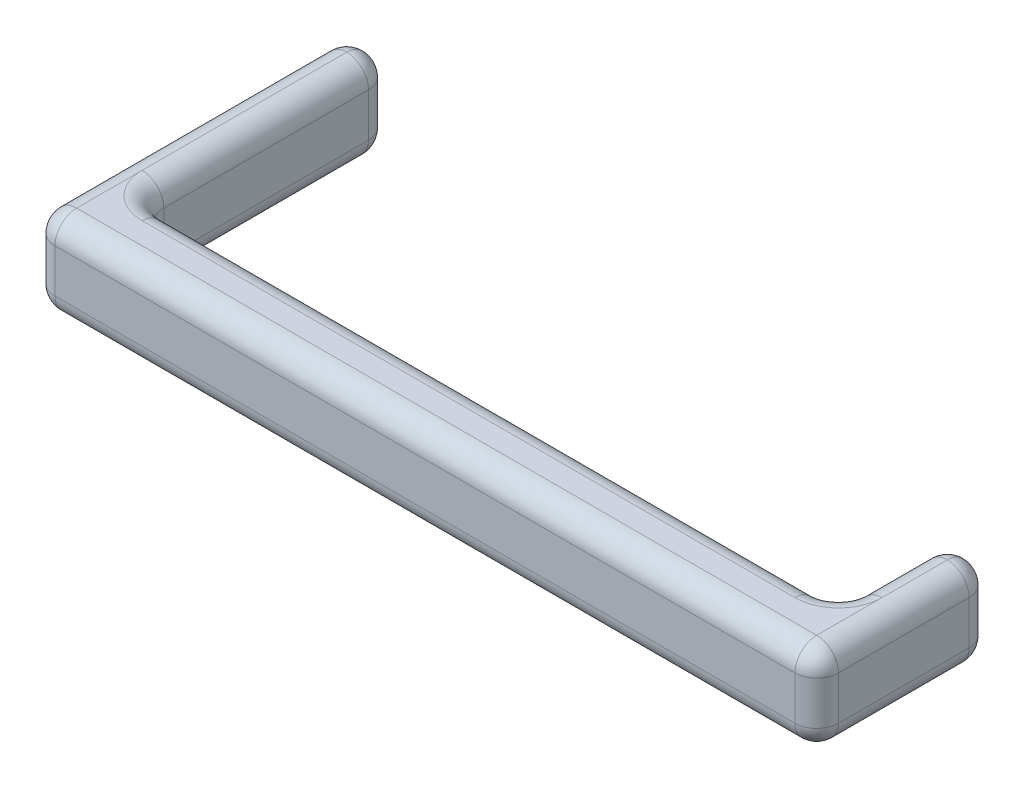
ISO-10303-21;
HEADER;
FILE_DESCRIPTION(('STEP AP214'),'2;1');
FILE_NAME('part.step','',(''),(''),'','','');
FILE_SCHEMA(('AUTOMOTIVE_DESIGN { 1 0 10303 214 1 1 1 1 }'));
ENDSEC;
DATA;
#1=APPLICATION_CONTEXT('core data for automotive mechanical design processes');
#2=APPLICATION_PROTOCOL_DEFINITION('international standard','automotive_design',2000,#1);
#3=PRODUCT_CONTEXT('',#1,'mechanical');
#4=PRODUCT('Part','Part','',(#3));
#5=PRODUCT_RELATED_PRODUCT_CATEGORY('part','',(#4));
#6=PRODUCT_DEFINITION_FORMATION('','',#4);
#7=PRODUCT_DEFINITION_CONTEXT('part definition',#1,'design');
#8=PRODUCT_DEFINITION('design','',#6,#7);
#9=PRODUCT_DEFINITION_SHAPE('','',#8);
#10=(LENGTH_UNIT() NAMED_UNIT(*) SI_UNIT(.MILLI.,.METRE.));
#11=(NAMED_UNIT(*) PLANE_ANGLE_UNIT() SI_UNIT($,.RADIAN.));
#12=(NAMED_UNIT(*) SI_UNIT($,.STERADIAN.) SOLID_ANGLE_UNIT());
#13=UNCERTAINTY_MEASURE_WITH_UNIT(LENGTH_MEASURE(1.E-05),#10,'distance_accuracy_value','');
#14=(GEOMETRIC_REPRESENTATION_CONTEXT(3) GLOBAL_UNCERTAINTY_ASSIGNED_CONTEXT((#13)) GLOBAL_UNIT_ASSIGNED_CONTEXT((#10,
#11,#12)) REPRESENTATION_CONTEXT('',''));
#15=CARTESIAN_POINT('',(0.,0.,0.));
#16=DIRECTION('',(0.,0.,1.));
#17=DIRECTION('',(1.,0.,0.));
#18=AXIS2_PLACEMENT_3D('',#15,#16,#17);
#19=CARTESIAN_POINT('',(0.,101.6,76.2));
#20=DIRECTION('',(0.,-1.,0.));
#21=DIRECTION('',(1.,0.,0.));
#22=AXIS2_PLACEMENT_3D('',#19,#20,#21);
#23=PLANE('',#22);
#24=CARTESIAN_POINT('',(-787.4,101.6,-25.4));
#25=DIRECTION('',(0.,-1.,0.));
#26=DIRECTION('',(1.,0.,0.));
#27=AXIS2_PLACEMENT_3D('',#24,#25,#26);
#28=CIRCLE('',#27,50.8);
#29=CARTESIAN_POINT('',(-838.2,101.6,-25.4));
#30=VERTEX_POINT('',#29);
#31=CARTESIAN_POINT('',(-787.4,101.6,25.4));
#32=VERTEX_POINT('',#31);
#33=EDGE_CURVE('E384',#30,#32,#28,.F.);
#34=ORIENTED_EDGE('',*,*,#33,.F.);
#35=DIRECTION('',(0.,0.,1.));
#36=VECTOR('',#35,1.);
#37=CARTESIAN_POINT('',(-838.2,101.6,76.2));
#38=LINE('',#37,#36);
#39=CARTESIAN_POINT('',(-838.2,101.6,50.8));
#40=VERTEX_POINT('',#39);
#41=EDGE_CURVE('E382',#30,#40,#38,.T.);
#42=ORIENTED_EDGE('',*,*,#41,.T.);
#43=DIRECTION('',(-1.,0.,0.));
#44=VECTOR('',#43,1.);
#45=CARTESIAN_POINT('',(50.8,101.6,50.8));
#46=LINE('',#45,#44);
#47=CARTESIAN_POINT('',(25.4,101.6,50.8));
#48=VERTEX_POINT('',#47);
#49=EDGE_CURVE('E375',#40,#48,#46,.F.);
#50=ORIENTED_EDGE('',*,*,#49,.T.);
#51=DIRECTION('',(0.,0.,1.));
#52=VECTOR('',#51,1.);
#53=CARTESIAN_POINT('',(25.4,101.6,76.2));
#54=LINE('',#53,#52);
#55=CARTESIAN_POINT('',(25.4,101.6,-25.4));
#56=VERTEX_POINT('',#55);
#57=EDGE_CURVE('E373',#48,#56,#54,.F.);
#58=ORIENTED_EDGE('',*,*,#57,.T.);
#59=CARTESIAN_POINT('',(-25.4,101.6,-25.4));
#60=DIRECTION('',(0.,-1.,0.));
#61=DIRECTION('',(1.,0.,0.));
#62=AXIS2_PLACEMENT_3D('',#59,#60,#61);
#63=CIRCLE('',#62,50.8);
#64=CARTESIAN_POINT('',(-25.4,101.6,25.4));
#65=VERTEX_POINT('',#64);
#66=EDGE_CURVE('E377',#65,#56,#63,.F.);
#67=ORIENTED_EDGE('',*,*,#66,.F.);
#68=DIRECTION('',(-1.,0.,0.));
#69=VECTOR('',#68,1.);
#70=CARTESIAN_POINT('',(0.,101.6,25.4));
#71=LINE('',#70,#69);
#72=EDGE_CURVE('E380',#65,#32,#71,.T.);
#73=ORIENTED_EDGE('',*,*,#72,.T.);
#74=EDGE_LOOP('',(#34,#42,#50,#58,#67,#73));
#75=FACE_BOUND('',#74,.T.);
#76=ADVANCED_FACE('F38',(#75),#23,.F.);
#77=CARTESIAN_POINT('',(0.,0.,76.2));
#78=DIRECTION('',(0.,1.,0.));
#79=DIRECTION('',(0.,0.,1.));
#80=AXIS2_PLACEMENT_3D('',#77,#78,#79);
#81=PLANE('',#80);
#82=DIRECTION('',(1.,0.,0.));
#83=VECTOR('',#82,1.);
#84=CARTESIAN_POINT('',(-863.6,0.,50.8));
#85=LINE('',#84,#83);
#86=CARTESIAN_POINT('',(25.4,0.,50.8));
#87=VERTEX_POINT('',#86);
#88=CARTESIAN_POINT('',(-838.2,0.,50.8));
#89=VERTEX_POINT('',#88);
#90=EDGE_CURVE('E350',#87,#89,#85,.F.);
#91=ORIENTED_EDGE('',*,*,#90,.T.);
#92=DIRECTION('',(0.,0.,1.));
#93=VECTOR('',#92,1.);
#94=CARTESIAN_POINT('',(-838.2,0.,-289.687));
#95=LINE('',#94,#93);
#96=CARTESIAN_POINT('',(-838.2,0.,-25.4));
#97=VERTEX_POINT('',#96);
#98=EDGE_CURVE('E352',#89,#97,#95,.F.);
#99=ORIENTED_EDGE('',*,*,#98,.T.);
#100=CARTESIAN_POINT('',(-787.4,0.,-25.4));
#101=DIRECTION('',(0.,1.,0.));
#102=DIRECTION('',(0.,0.,1.));
#103=AXIS2_PLACEMENT_3D('',#100,#101,#102);
#104=CIRCLE('',#103,50.8);
#105=CARTESIAN_POINT('',(-787.4,0.,25.4));
#106=VERTEX_POINT('',#105);
#107=EDGE_CURVE('E347',#106,#97,#104,.F.);
#108=ORIENTED_EDGE('',*,*,#107,.F.);
#109=DIRECTION('',(1.,0.,0.));
#110=VECTOR('',#109,1.);
#111=CARTESIAN_POINT('',(0.,0.,25.4));
#112=LINE('',#111,#110);
#113=CARTESIAN_POINT('',(-25.4,0.,25.4));
#114=VERTEX_POINT('',#113);
#115=EDGE_CURVE('E345',#106,#114,#112,.T.);
#116=ORIENTED_EDGE('',*,*,#115,.T.);
#117=CARTESIAN_POINT('',(-25.4,0.,-25.4));
#118=DIRECTION('',(0.,1.,0.));
#119=DIRECTION('',(0.,0.,1.));
#120=AXIS2_PLACEMENT_3D('',#117,#118,#119);
#121=CIRCLE('',#120,50.8);
#122=CARTESIAN_POINT('',(25.4,0.,-25.4));
#123=VERTEX_POINT('',#122);
#124=EDGE_CURVE('E342',#123,#114,#121,.F.);
#125=ORIENTED_EDGE('',*,*,#124,.F.);
#126=DIRECTION('',(0.,0.,1.));
#127=VECTOR('',#126,1.);
#128=CARTESIAN_POINT('',(25.4,0.,76.2));
#129=LINE('',#128,#127);
#130=EDGE_CURVE('E340',#123,#87,#129,.T.);
#131=ORIENTED_EDGE('',*,*,#130,.T.);
#132=EDGE_LOOP('',(#91,#99,#108,#116,#125,#131));
#133=FACE_BOUND('',#132,.T.);
#134=ADVANCED_FACE('F458',(#133),#81,.F.);
#135=CARTESIAN_POINT('',(0.,0.,76.2));
#136=DIRECTION('',(0.,0.,1.));
#137=DIRECTION('',(1.,0.,0.));
#138=AXIS2_PLACEMENT_3D('',#135,#136,#137);
#139=PLANE('',#138);
#140=DIRECTION('',(-1.,0.,0.));
#141=VECTOR('',#140,1.);
#142=CARTESIAN_POINT('',(-863.6,76.1999999999999,76.2));
#143=LINE('',#142,#141);
#144=CARTESIAN_POINT('',(25.4,76.2,76.2));
#145=VERTEX_POINT('',#144);
#146=CARTESIAN_POINT('',(-838.2,76.1999999999999,76.2));
#147=VERTEX_POINT('',#146);
#148=EDGE_CURVE('E324',#145,#147,#143,.T.);
#149=ORIENTED_EDGE('',*,*,#148,.T.);
#150=DIRECTION('',(0.,-1.,0.));
#151=VECTOR('',#150,1.);
#152=CARTESIAN_POINT('',(-838.2,0.,76.2));
#153=LINE('',#152,#151);
#154=CARTESIAN_POINT('',(-838.2,25.4,76.2));
#155=VERTEX_POINT('',#154);
#156=EDGE_CURVE('E329',#147,#155,#153,.T.);
#157=ORIENTED_EDGE('',*,*,#156,.T.);
#158=DIRECTION('',(1.,0.,0.));
#159=VECTOR('',#158,1.);
#160=CARTESIAN_POINT('',(50.8,25.4,76.2));
#161=LINE('',#160,#159);
#162=CARTESIAN_POINT('',(25.4,25.4,76.2));
#163=VERTEX_POINT('',#162);
#164=EDGE_CURVE('E98',#155,#163,#161,.T.);
#165=ORIENTED_EDGE('',*,*,#164,.T.);
#166=DIRECTION('',(0.,-1.,0.));
#167=VECTOR('',#166,1.);
#168=CARTESIAN_POINT('',(25.4,101.6,76.2));
#169=LINE('',#168,#167);
#170=EDGE_CURVE('E221',#163,#145,#169,.F.);
#171=ORIENTED_EDGE('',*,*,#170,.T.);
#172=EDGE_LOOP('',(#149,#157,#165,#171));
#173=FACE_BOUND('',#172,.T.);
#174=ADVANCED_FACE('F545',(#173),#139,.T.);
#175=CARTESIAN_POINT('',(0.,0.,0.));
#176=DIRECTION('',(0.,0.,1.));
#177=DIRECTION('',(1.,0.,0.));
#178=AXIS2_PLACEMENT_3D('',#175,#176,#177);
#179=PLANE('',#178);
#180=DIRECTION('',(0.,-1.,0.));
#181=VECTOR('',#180,1.);
#182=CARTESIAN_POINT('',(-787.4,101.6,0.));
#183=LINE('',#182,#181);
#184=CARTESIAN_POINT('',(-787.4,25.4,0.));
#185=VERTEX_POINT('',#184);
#186=CARTESIAN_POINT('',(-787.4,76.1999999999999,0.));
#187=VERTEX_POINT('',#186);
#188=EDGE_CURVE('E391',#185,#187,#183,.F.);
#189=ORIENTED_EDGE('',*,*,#188,.T.);
#190=DIRECTION('',(-1.,0.,0.));
#191=VECTOR('',#190,1.);
#192=CARTESIAN_POINT('',(0.,76.2,0.));
#193=LINE('',#192,#191);
#194=CARTESIAN_POINT('',(-25.4,76.2,0.));
#195=VERTEX_POINT('',#194);
#196=EDGE_CURVE('E204',#187,#195,#193,.F.);
#197=ORIENTED_EDGE('',*,*,#196,.T.);
#198=DIRECTION('',(0.,1.,0.));
#199=VECTOR('',#198,1.);
#200=CARTESIAN_POINT('',(-25.4,0.,0.));
#201=LINE('',#200,#199);
#202=CARTESIAN_POINT('',(-25.4,25.4,0.));
#203=VERTEX_POINT('',#202);
#204=EDGE_CURVE('E387',#195,#203,#201,.F.);
#205=ORIENTED_EDGE('',*,*,#204,.T.);
#206=DIRECTION('',(1.,0.,0.));
#207=VECTOR('',#206,1.);
#208=CARTESIAN_POINT('',(0.,25.4,0.));
#209=LINE('',#208,#207);
#210=EDGE_CURVE('E389',#203,#185,#209,.F.);
#211=ORIENTED_EDGE('',*,*,#210,.T.);
#212=EDGE_LOOP('',(#189,#197,#205,#211));
#213=FACE_BOUND('',#212,.T.);
#214=ADVANCED_FACE('F500',(#213),#179,.F.);
#215=CARTESIAN_POINT('',(-812.8,101.6,-127.));
#216=DIRECTION('',(-1.,0.,0.));
#217=DIRECTION('',(0.,0.,1.));
#218=AXIS2_PLACEMENT_3D('',#215,#216,#217);
#219=PLANE('',#218);
#220=DIRECTION('',(0.,0.,1.));
#221=VECTOR('',#220,1.);
#222=CARTESIAN_POINT('',(-812.8,25.4,-127.));
#223=LINE('',#222,#221);
#224=CARTESIAN_POINT('',(-812.8,25.4,-25.4));
#225=VERTEX_POINT('',#224);
#226=CARTESIAN_POINT('',(-812.8,25.4,-264.287));
#227=VERTEX_POINT('',#226);
#228=EDGE_CURVE('E368',#225,#227,#223,.F.);
#229=ORIENTED_EDGE('',*,*,#228,.T.);
#230=DIRECTION('',(0.,1.,0.));
#231=VECTOR('',#230,1.);
#232=CARTESIAN_POINT('',(-812.8,101.6,-264.287));
#233=LINE('',#232,#231);
#234=CARTESIAN_POINT('',(-812.8,76.1999999999999,-264.287));
#235=VERTEX_POINT('',#234);
#236=EDGE_CURVE('E371',#227,#235,#233,.T.);
#237=ORIENTED_EDGE('',*,*,#236,.T.);
#238=DIRECTION('',(0.,0.,1.));
#239=VECTOR('',#238,1.);
#240=CARTESIAN_POINT('',(-812.8,76.1999999999999,-127.));
#241=LINE('',#240,#239);
#242=CARTESIAN_POINT('',(-812.8,76.1999999999999,-25.4));
#243=VERTEX_POINT('',#242);
#244=EDGE_CURVE('E366',#235,#243,#241,.T.);
#245=ORIENTED_EDGE('',*,*,#244,.T.);
#246=DIRECTION('',(0.,-1.,0.));
#247=VECTOR('',#246,1.);
#248=CARTESIAN_POINT('',(-812.8,0.,-25.4));
#249=LINE('',#248,#247);
#250=EDGE_CURVE('E364',#243,#225,#249,.T.);
#251=ORIENTED_EDGE('',*,*,#250,.T.);
#252=EDGE_LOOP('',(#229,#237,#245,#251));
#253=FACE_BOUND('',#252,.T.);
#254=ADVANCED_FACE('F443',(#253),#219,.F.);
#255=CARTESIAN_POINT('',(-863.6,101.6,-127.));
#256=DIRECTION('',(-1.,0.,0.));
#257=DIRECTION('',(0.,0.,1.));
#258=AXIS2_PLACEMENT_3D('',#255,#256,#257);
#259=PLANE('',#258);
#260=DIRECTION('',(0.,0.,1.));
#261=VECTOR('',#260,1.);
#262=CARTESIAN_POINT('',(-863.6,25.4,76.2));
#263=LINE('',#262,#261);
#264=CARTESIAN_POINT('',(-863.6,25.4,-264.287));
#265=VERTEX_POINT('',#264);
#266=CARTESIAN_POINT('',(-863.6,25.4,50.8));
#267=VERTEX_POINT('',#266);
#268=EDGE_CURVE('E335',#265,#267,#263,.T.);
#269=ORIENTED_EDGE('',*,*,#268,.T.);
#270=DIRECTION('',(0.,-1.,0.));
#271=VECTOR('',#270,1.);
#272=CARTESIAN_POINT('',(-863.6,101.6,50.8));
#273=LINE('',#272,#271);
#274=CARTESIAN_POINT('',(-863.6,76.1999999999999,50.8));
#275=VERTEX_POINT('',#274);
#276=EDGE_CURVE('E337',#267,#275,#273,.F.);
#277=ORIENTED_EDGE('',*,*,#276,.T.);
#278=DIRECTION('',(0.,0.,1.));
#279=VECTOR('',#278,1.);
#280=CARTESIAN_POINT('',(-863.6,76.1999999999999,-289.687));
#281=LINE('',#280,#279);
#282=CARTESIAN_POINT('',(-863.6,76.1999999999999,-264.287));
#283=VERTEX_POINT('',#282);
#284=EDGE_CURVE('E333',#275,#283,#281,.F.);
#285=ORIENTED_EDGE('',*,*,#284,.T.);
#286=DIRECTION('',(0.,-1.,0.));
#287=VECTOR('',#286,1.);
#288=CARTESIAN_POINT('',(-863.6,101.6,-264.287));
#289=LINE('',#288,#287);
#290=EDGE_CURVE('E331',#283,#265,#289,.T.);
#291=ORIENTED_EDGE('',*,*,#290,.T.);
#292=EDGE_LOOP('',(#269,#277,#285,#291));
#293=FACE_BOUND('',#292,.T.);
#294=ADVANCED_FACE('F475',(#293),#259,.T.);
#295=CARTESIAN_POINT('',(0.,101.6,-127.));
#296=DIRECTION('',(-1.,0.,0.));
#297=DIRECTION('',(0.,0.,1.));
#298=AXIS2_PLACEMENT_3D('',#295,#296,#297);
#299=PLANE('',#298);
#300=DIRECTION('',(0.,0.,1.));
#301=VECTOR('',#300,1.);
#302=CARTESIAN_POINT('',(0.,76.2,-127.));
#303=LINE('',#302,#301);
#304=CARTESIAN_POINT('',(0.,76.2,-25.4));
#305=VERTEX_POINT('',#304);
#306=CARTESIAN_POINT('',(0.,76.2,-101.6));
#307=VERTEX_POINT('',#306);
#308=EDGE_CURVE('E357',#305,#307,#303,.F.);
#309=ORIENTED_EDGE('',*,*,#308,.T.);
#310=DIRECTION('',(0.,-1.,0.));
#311=VECTOR('',#310,1.);
#312=CARTESIAN_POINT('',(0.,101.6,-101.6));
#313=LINE('',#312,#311);
#314=CARTESIAN_POINT('',(0.,25.4,-101.6));
#315=VERTEX_POINT('',#314);
#316=EDGE_CURVE('E362',#307,#315,#313,.T.);
#317=ORIENTED_EDGE('',*,*,#316,.T.);
#318=DIRECTION('',(0.,0.,1.));
#319=VECTOR('',#318,1.);
#320=CARTESIAN_POINT('',(0.,25.4,0.));
#321=LINE('',#320,#319);
#322=CARTESIAN_POINT('',(0.,25.4,-25.4));
#323=VERTEX_POINT('',#322);
#324=EDGE_CURVE('E359',#315,#323,#321,.T.);
#325=ORIENTED_EDGE('',*,*,#324,.T.);
#326=DIRECTION('',(0.,1.,0.));
#327=VECTOR('',#326,1.);
#328=CARTESIAN_POINT('',(0.,101.6,-25.4));
#329=LINE('',#328,#327);
#330=EDGE_CURVE('E355',#323,#305,#329,.T.);
#331=ORIENTED_EDGE('',*,*,#330,.T.);
#332=EDGE_LOOP('',(#309,#317,#325,#331));
#333=FACE_BOUND('',#332,.T.);
#334=ADVANCED_FACE('F523',(#333),#299,.T.);
#335=CARTESIAN_POINT('',(50.8,101.6,-127.));
#336=DIRECTION('',(-1.,0.,0.));
#337=DIRECTION('',(0.,-1.,0.));
#338=AXIS2_PLACEMENT_3D('',#335,#336,#337);
#339=PLANE('',#338);
#340=DIRECTION('',(0.,-1.,0.));
#341=VECTOR('',#340,1.);
#342=CARTESIAN_POINT('',(50.8,101.6,-101.6));
#343=LINE('',#342,#341);
#344=CARTESIAN_POINT('',(50.8,25.4,-101.6));
#345=VERTEX_POINT('',#344);
#346=CARTESIAN_POINT('',(50.8,76.2,-101.6));
#347=VERTEX_POINT('',#346);
#348=EDGE_CURVE('E48',#345,#347,#343,.F.);
#349=ORIENTED_EDGE('',*,*,#348,.T.);
#350=DIRECTION('',(0.,0.,1.));
#351=VECTOR('',#350,1.);
#352=CARTESIAN_POINT('',(50.8,76.2,-127.));
#353=LINE('',#352,#351);
#354=CARTESIAN_POINT('',(50.8,76.2,50.8));
#355=VERTEX_POINT('',#354);
#356=EDGE_CURVE('E11',#347,#355,#353,.T.);
#357=ORIENTED_EDGE('',*,*,#356,.T.);
#358=DIRECTION('',(0.,-1.,0.));
#359=VECTOR('',#358,1.);
#360=CARTESIAN_POINT('',(50.8,0.,50.8));
#361=LINE('',#360,#359);
#362=CARTESIAN_POINT('',(50.8,25.4,50.8));
#363=VERTEX_POINT('',#362);
#364=EDGE_CURVE('E196',#355,#363,#361,.T.);
#365=ORIENTED_EDGE('',*,*,#364,.T.);
#366=DIRECTION('',(0.,0.,1.));
#367=VECTOR('',#366,1.);
#368=CARTESIAN_POINT('',(50.8,25.4,-127.));
#369=LINE('',#368,#367);
#370=EDGE_CURVE('E199',#363,#345,#369,.F.);
#371=ORIENTED_EDGE('',*,*,#370,.T.);
#372=EDGE_LOOP('',(#349,#357,#365,#371));
#373=FACE_BOUND('',#372,.T.);
#374=ADVANCED_FACE('F198',(#373),#339,.F.);
#375=CARTESIAN_POINT('',(25.4,101.6,-101.6));
#376=DIRECTION('',(0.,-1.,0.));
#377=DIRECTION('',(0.,0.,-1.));
#378=AXIS2_PLACEMENT_3D('',#375,#376,#377);
#379=CYLINDRICAL_SURFACE('',#378,25.4);
#380=CARTESIAN_POINT('',(25.4,25.4,-101.6));
#381=DIRECTION('',(0.,-1.,0.));
#382=DIRECTION('',(0.,0.,-1.));
#383=AXIS2_PLACEMENT_3D('',#380,#381,#382);
#384=CIRCLE('',#383,25.4);
#385=CARTESIAN_POINT('',(25.4,25.4,-127.));
#386=VERTEX_POINT('',#385);
#387=EDGE_CURVE('E311',#315,#386,#384,.T.);
#388=ORIENTED_EDGE('',*,*,#387,.F.);
#389=ORIENTED_EDGE('',*,*,#316,.F.);
#390=CARTESIAN_POINT('',(25.4,76.2,-101.6));
#391=DIRECTION('',(0.,1.,0.));
#392=DIRECTION('',(0.,0.,1.));
#393=AXIS2_PLACEMENT_3D('',#390,#391,#392);
#394=CIRCLE('',#393,25.4);
#395=CARTESIAN_POINT('',(25.4,76.2,-127.));
#396=VERTEX_POINT('',#395);
#397=EDGE_CURVE('E84',#396,#307,#394,.T.);
#398=ORIENTED_EDGE('',*,*,#397,.F.);
#399=DIRECTION('',(0.,-1.,0.));
#400=VECTOR('',#399,1.);
#401=CARTESIAN_POINT('',(25.4,0.,-127.));
#402=LINE('',#401,#400);
#403=EDGE_CURVE('E89',#386,#396,#402,.F.);
#404=ORIENTED_EDGE('',*,*,#403,.F.);
#405=EDGE_LOOP('',(#388,#389,#398,#404));
#406=FACE_BOUND('',#405,.T.);
#407=ADVANCED_FACE('F40',(#406),#379,.T.);
#408=CARTESIAN_POINT('',(-25.4,101.6,-25.4));
#409=DIRECTION('',(0.,1.,0.));
#410=DIRECTION('',(0.,0.,1.));
#411=AXIS2_PLACEMENT_3D('',#408,#409,#410);
#412=CYLINDRICAL_SURFACE('',#411,25.4);
#413=CARTESIAN_POINT('',(-25.4,76.2,-25.4));
#414=DIRECTION('',(0.,-1.,0.));
#415=DIRECTION('',(1.,0.,0.));
#416=AXIS2_PLACEMENT_3D('',#413,#414,#415);
#417=CIRCLE('',#416,25.4);
#418=EDGE_CURVE('E42',#305,#195,#417,.T.);
#419=ORIENTED_EDGE('',*,*,#418,.F.);
#420=ORIENTED_EDGE('',*,*,#330,.F.);
#421=CARTESIAN_POINT('',(-25.4,25.4,-25.4));
#422=DIRECTION('',(0.,1.,0.));
#423=DIRECTION('',(0.,0.,1.));
#424=AXIS2_PLACEMENT_3D('',#421,#422,#423);
#425=CIRCLE('',#424,25.4);
#426=EDGE_CURVE('E308',#203,#323,#425,.T.);
#427=ORIENTED_EDGE('',*,*,#426,.F.);
#428=ORIENTED_EDGE('',*,*,#204,.F.);
#429=EDGE_LOOP('',(#419,#420,#427,#428));
#430=FACE_BOUND('',#429,.T.);
#431=ADVANCED_FACE('F635',(#430),#412,.F.);
#432=CARTESIAN_POINT('',(-25.4,76.2,-25.4));
#433=DIRECTION('',(0.,-1.,0.));
#434=DIRECTION('',(1.,0.,0.));
#435=AXIS2_PLACEMENT_3D('',#432,#433,#434);
#436=TOROIDAL_SURFACE('',#435,50.8,25.4);
#437=CARTESIAN_POINT('',(25.4,76.2,-25.4));
#438=DIRECTION('',(0.,0.,1.));
#439=DIRECTION('',(1.,0.,0.));
#440=AXIS2_PLACEMENT_3D('',#437,#438,#439);
#441=CIRCLE('',#440,25.4);
#442=EDGE_CURVE('E303',#305,#56,#441,.F.);
#443=ORIENTED_EDGE('',*,*,#442,.F.);
#444=ORIENTED_EDGE('',*,*,#418,.T.);
#445=CARTESIAN_POINT('',(-25.4,76.2,25.4));
#446=DIRECTION('',(1.,0.,0.));
#447=DIRECTION('',(0.,1.,0.));
#448=AXIS2_PLACEMENT_3D('',#445,#446,#447);
#449=CIRCLE('',#448,25.4);
#450=EDGE_CURVE('E306',#65,#195,#449,.F.);
#451=ORIENTED_EDGE('',*,*,#450,.F.);
#452=ORIENTED_EDGE('',*,*,#66,.T.);
#453=EDGE_LOOP('',(#443,#444,#451,#452));
#454=FACE_BOUND('',#453,.T.);
#455=ADVANCED_FACE('F633',(#454),#436,.T.);
#456=CARTESIAN_POINT('',(25.4,76.2,-101.6));
#457=DIRECTION('',(0.,0.,1.));
#458=DIRECTION('',(1.,0.,0.));
#459=AXIS2_PLACEMENT_3D('',#456,#457,#458);
#460=SPHERICAL_SURFACE('',#459,25.4);
#461=CARTESIAN_POINT('',(25.4,76.2,-101.6));
#462=DIRECTION('',(-1.,0.,0.));
#463=DIRECTION('',(0.,-1.,0.));
#464=AXIS2_PLACEMENT_3D('',#461,#462,#463);
#465=CIRCLE('',#464,25.4);
#466=CARTESIAN_POINT('',(25.4,101.6,-101.6));
#467=VERTEX_POINT('',#466);
#468=EDGE_CURVE('E315',#396,#467,#465,.F.);
#469=ORIENTED_EDGE('',*,*,#468,.F.);
#470=ORIENTED_EDGE('',*,*,#397,.T.);
#471=CARTESIAN_POINT('',(25.4,76.2,-101.6));
#472=DIRECTION('',(0.,0.,-1.));
#473=DIRECTION('',(-1.,0.,0.));
#474=AXIS2_PLACEMENT_3D('',#471,#472,#473);
#475=CIRCLE('',#474,25.4);
#476=EDGE_CURVE('E300',#467,#307,#475,.F.);
#477=ORIENTED_EDGE('',*,*,#476,.F.);
#478=EDGE_LOOP('',(#469,#470,#477));
#479=FACE_BOUND('',#478,.T.);
#480=ADVANCED_FACE('F528',(#479),#460,.T.);
#481=CARTESIAN_POINT('',(25.4,0.,-101.6));
#482=DIRECTION('',(0.,1.,0.));
#483=DIRECTION('',(-1.,0.,0.));
#484=AXIS2_PLACEMENT_3D('',#481,#482,#483);
#485=CYLINDRICAL_SURFACE('',#484,25.4);
#486=CARTESIAN_POINT('',(25.4,25.4,-101.6));
#487=DIRECTION('',(0.,-1.,0.));
#488=DIRECTION('',(1.,0.,0.));
#489=AXIS2_PLACEMENT_3D('',#486,#487,#488);
#490=CIRCLE('',#489,25.4);
#491=EDGE_CURVE('E294',#386,#345,#490,.T.);
#492=ORIENTED_EDGE('',*,*,#491,.F.);
#493=ORIENTED_EDGE('',*,*,#403,.T.);
#494=CARTESIAN_POINT('',(25.4,76.2,-101.6));
#495=DIRECTION('',(0.,1.,0.));
#496=DIRECTION('',(0.,0.,1.));
#497=AXIS2_PLACEMENT_3D('',#494,#495,#496);
#498=CIRCLE('',#497,25.4);
#499=EDGE_CURVE('E297',#347,#396,#498,.T.);
#500=ORIENTED_EDGE('',*,*,#499,.F.);
#501=ORIENTED_EDGE('',*,*,#348,.F.);
#502=EDGE_LOOP('',(#492,#493,#500,#501));
#503=FACE_BOUND('',#502,.T.);
#504=ADVANCED_FACE('F520',(#503),#485,.T.);
#505=CARTESIAN_POINT('',(25.4,25.4,-101.6));
#506=DIRECTION('',(0.,0.,1.));
#507=DIRECTION('',(1.,0.,0.));
#508=AXIS2_PLACEMENT_3D('',#505,#506,#507);
#509=SPHERICAL_SURFACE('',#508,25.4);
#510=ORIENTED_EDGE('',*,*,#387,.T.);
#511=CARTESIAN_POINT('',(25.4,25.4,-101.6));
#512=DIRECTION('',(1.,0.,0.));
#513=DIRECTION('',(0.,0.,-1.));
#514=AXIS2_PLACEMENT_3D('',#511,#512,#513);
#515=CIRCLE('',#514,25.4);
#516=CARTESIAN_POINT('',(25.4,0.,-101.6));
#517=VERTEX_POINT('',#516);
#518=EDGE_CURVE('E292',#517,#386,#515,.T.);
#519=ORIENTED_EDGE('',*,*,#518,.F.);
#520=CARTESIAN_POINT('',(25.4,25.4,-101.6));
#521=DIRECTION('',(0.,0.,-1.));
#522=DIRECTION('',(-1.,0.,0.));
#523=AXIS2_PLACEMENT_3D('',#520,#521,#522);
#524=CIRCLE('',#523,25.4);
#525=EDGE_CURVE('E289',#315,#517,#524,.F.);
#526=ORIENTED_EDGE('',*,*,#525,.F.);
#527=EDGE_LOOP('',(#510,#519,#526));
#528=FACE_BOUND('',#527,.T.);
#529=ADVANCED_FACE('F521',(#528),#509,.T.);
#530=CARTESIAN_POINT('',(-25.4,25.4,-25.4));
#531=DIRECTION('',(0.,1.,0.));
#532=DIRECTION('',(0.,0.,1.));
#533=AXIS2_PLACEMENT_3D('',#530,#531,#532);
#534=TOROIDAL_SURFACE('',#533,50.8,25.4);
#535=CARTESIAN_POINT('',(-25.4,25.4,25.4));
#536=DIRECTION('',(1.,0.,0.));
#537=DIRECTION('',(0.,0.,-1.));
#538=AXIS2_PLACEMENT_3D('',#535,#536,#537);
#539=CIRCLE('',#538,25.4);
#540=EDGE_CURVE('E284',#203,#114,#539,.F.);
#541=ORIENTED_EDGE('',*,*,#540,.F.);
#542=ORIENTED_EDGE('',*,*,#426,.T.);
#543=CARTESIAN_POINT('',(25.4,25.4,-25.4));
#544=DIRECTION('',(0.,0.,1.));
#545=DIRECTION('',(1.,0.,0.));
#546=AXIS2_PLACEMENT_3D('',#543,#544,#545);
#547=CIRCLE('',#546,25.4);
#548=EDGE_CURVE('E287',#123,#323,#547,.F.);
#549=ORIENTED_EDGE('',*,*,#548,.F.);
#550=ORIENTED_EDGE('',*,*,#124,.T.);
#551=EDGE_LOOP('',(#541,#542,#549,#550));
#552=FACE_BOUND('',#551,.T.);
#553=ADVANCED_FACE('F508',(#552),#534,.T.);
#554=CARTESIAN_POINT('',(0.,76.2,25.4));
#555=DIRECTION('',(-1.,0.,0.));
#556=DIRECTION('',(0.,-1.,0.));
#557=AXIS2_PLACEMENT_3D('',#554,#555,#556);
#558=CYLINDRICAL_SURFACE('',#557,25.4);
#559=ORIENTED_EDGE('',*,*,#450,.T.);
#560=ORIENTED_EDGE('',*,*,#196,.F.);
#561=CARTESIAN_POINT('',(-787.4,76.1999999999999,25.4));
#562=DIRECTION('',(-1.,0.,0.));
#563=DIRECTION('',(0.,0.,1.));
#564=AXIS2_PLACEMENT_3D('',#561,#562,#563);
#565=CIRCLE('',#564,25.4);
#566=EDGE_CURVE('E275',#32,#187,#565,.T.);
#567=ORIENTED_EDGE('',*,*,#566,.F.);
#568=ORIENTED_EDGE('',*,*,#72,.F.);
#569=EDGE_LOOP('',(#559,#560,#567,#568));
#570=FACE_BOUND('',#569,.T.);
#571=ADVANCED_FACE('F498',(#570),#558,.T.);
#572=CARTESIAN_POINT('',(25.4,76.2,76.2));
#573=DIRECTION('',(0.,0.,-1.));
#574=DIRECTION('',(-1.,0.,0.));
#575=AXIS2_PLACEMENT_3D('',#572,#573,#574);
#576=CYLINDRICAL_SURFACE('',#575,25.4);
#577=ORIENTED_EDGE('',*,*,#308,.F.);
#578=ORIENTED_EDGE('',*,*,#442,.T.);
#579=DIRECTION('',(0.,0.,1.));
#580=VECTOR('',#579,1.);
#581=CARTESIAN_POINT('',(25.4,101.6,0.));
#582=LINE('',#581,#580);
#583=EDGE_CURVE('E272',#467,#56,#582,.T.);
#584=ORIENTED_EDGE('',*,*,#583,.F.);
#585=ORIENTED_EDGE('',*,*,#476,.T.);
#586=EDGE_LOOP('',(#577,#578,#584,#585));
#587=FACE_BOUND('',#586,.T.);
#588=ADVANCED_FACE('F526',(#587),#576,.T.);
#589=CARTESIAN_POINT('',(25.4,76.2,-101.6));
#590=DIRECTION('',(0.,0.,1.));
#591=DIRECTION('',(1.,0.,0.));
#592=AXIS2_PLACEMENT_3D('',#589,#590,#591);
#593=SPHERICAL_SURFACE('',#592,25.4);
#594=ORIENTED_EDGE('',*,*,#499,.T.);
#595=ORIENTED_EDGE('',*,*,#468,.T.);
#596=CARTESIAN_POINT('',(25.4,76.2,-101.6));
#597=DIRECTION('',(0.,0.,-1.));
#598=DIRECTION('',(-1.,0.,0.));
#599=AXIS2_PLACEMENT_3D('',#596,#597,#598);
#600=CIRCLE('',#599,25.4);
#601=EDGE_CURVE('E269',#347,#467,#600,.F.);
#602=ORIENTED_EDGE('',*,*,#601,.F.);
#603=EDGE_LOOP('',(#594,#595,#602));
#604=FACE_BOUND('',#603,.T.);
#605=ADVANCED_FACE('F531',(#604),#593,.T.);
#606=CARTESIAN_POINT('',(25.4,25.4,-101.6));
#607=DIRECTION('',(0.,0.,1.));
#608=DIRECTION('',(1.,0.,0.));
#609=AXIS2_PLACEMENT_3D('',#606,#607,#608);
#610=SPHERICAL_SURFACE('',#609,25.4);
#611=ORIENTED_EDGE('',*,*,#518,.T.);
#612=ORIENTED_EDGE('',*,*,#491,.T.);
#613=CARTESIAN_POINT('',(25.4,25.4,-101.6));
#614=DIRECTION('',(0.,0.,-1.));
#615=DIRECTION('',(0.,1.,0.));
#616=AXIS2_PLACEMENT_3D('',#613,#614,#615);
#617=CIRCLE('',#616,25.4);
#618=EDGE_CURVE('E216',#517,#345,#617,.F.);
#619=ORIENTED_EDGE('',*,*,#618,.F.);
#620=EDGE_LOOP('',(#611,#612,#619));
#621=FACE_BOUND('',#620,.T.);
#622=ADVANCED_FACE('F517',(#621),#610,.T.);
#623=CARTESIAN_POINT('',(25.4,25.4,-127.));
#624=DIRECTION('',(0.,0.,-1.));
#625=DIRECTION('',(-1.,0.,0.));
#626=AXIS2_PLACEMENT_3D('',#623,#624,#625);
#627=CYLINDRICAL_SURFACE('',#626,25.4);
#628=ORIENTED_EDGE('',*,*,#324,.F.);
#629=ORIENTED_EDGE('',*,*,#525,.T.);
#630=DIRECTION('',(0.,0.,1.));
#631=VECTOR('',#630,1.);
#632=CARTESIAN_POINT('',(25.4,0.,-127.));
#633=LINE('',#632,#631);
#634=EDGE_CURVE('E266',#123,#517,#633,.F.);
#635=ORIENTED_EDGE('',*,*,#634,.F.);
#636=ORIENTED_EDGE('',*,*,#548,.T.);
#637=EDGE_LOOP('',(#628,#629,#635,#636));
#638=FACE_BOUND('',#637,.T.);
#639=ADVANCED_FACE('F513',(#638),#627,.T.);
#640=CARTESIAN_POINT('',(0.,25.4,25.4));
#641=DIRECTION('',(1.,0.,0.));
#642=DIRECTION('',(0.,0.,-1.));
#643=AXIS2_PLACEMENT_3D('',#640,#641,#642);
#644=CYLINDRICAL_SURFACE('',#643,25.4);
#645=ORIENTED_EDGE('',*,*,#540,.T.);
#646=ORIENTED_EDGE('',*,*,#115,.F.);
#647=CARTESIAN_POINT('',(-787.4,25.4,25.4));
#648=DIRECTION('',(-1.,0.,0.));
#649=DIRECTION('',(0.,0.,1.));
#650=AXIS2_PLACEMENT_3D('',#647,#648,#649);
#651=CIRCLE('',#650,25.4);
#652=EDGE_CURVE('E263',#185,#106,#651,.T.);
#653=ORIENTED_EDGE('',*,*,#652,.F.);
#654=ORIENTED_EDGE('',*,*,#210,.F.);
#655=EDGE_LOOP('',(#645,#646,#653,#654));
#656=FACE_BOUND('',#655,.T.);
#657=ADVANCED_FACE('F504',(#656),#644,.T.);
#658=CARTESIAN_POINT('',(-787.4,101.6,-25.4));
#659=DIRECTION('',(0.,1.,0.));
#660=DIRECTION('',(0.,0.,1.));
#661=AXIS2_PLACEMENT_3D('',#658,#659,#660);
#662=CYLINDRICAL_SURFACE('',#661,25.4);
#663=CARTESIAN_POINT('',(-787.4,25.4,-25.4));
#664=DIRECTION('',(0.,1.,0.));
#665=DIRECTION('',(0.,0.,1.));
#666=AXIS2_PLACEMENT_3D('',#663,#664,#665);
#667=CIRCLE('',#666,25.4);
#668=EDGE_CURVE('E260',#225,#185,#667,.T.);
#669=ORIENTED_EDGE('',*,*,#668,.F.);
#670=ORIENTED_EDGE('',*,*,#250,.F.);
#671=CARTESIAN_POINT('',(-787.4,76.1999999999999,-25.4));
#672=DIRECTION('',(0.,-1.,0.));
#673=DIRECTION('',(1.,0.,0.));
#674=AXIS2_PLACEMENT_3D('',#671,#672,#673);
#675=CIRCLE('',#674,25.4);
#676=EDGE_CURVE('E278',#187,#243,#675,.T.);
#677=ORIENTED_EDGE('',*,*,#676,.F.);
#678=ORIENTED_EDGE('',*,*,#188,.F.);
#679=EDGE_LOOP('',(#669,#670,#677,#678));
#680=FACE_BOUND('',#679,.T.);
#681=ADVANCED_FACE('F451',(#680),#662,.F.);
#682=CARTESIAN_POINT('',(-838.2,101.6,-264.287));
#683=DIRECTION('',(0.,-1.,0.));
#684=DIRECTION('',(0.,0.,-1.));
#685=AXIS2_PLACEMENT_3D('',#682,#683,#684);
#686=CYLINDRICAL_SURFACE('',#685,25.4);
#687=DIRECTION('',(0.,1.,0.));
#688=VECTOR('',#687,1.);
#689=CARTESIAN_POINT('',(-838.2,0.,-289.687));
#690=LINE('',#689,#688);
#691=CARTESIAN_POINT('',(-838.2,76.1999999999999,-289.687));
#692=VERTEX_POINT('',#691);
#693=CARTESIAN_POINT('',(-838.2,25.4,-289.687));
#694=VERTEX_POINT('',#693);
#695=EDGE_CURVE('E251',#692,#694,#690,.F.);
#696=ORIENTED_EDGE('',*,*,#695,.F.);
#697=CARTESIAN_POINT('',(-838.2,76.1999999999999,-264.287));
#698=DIRECTION('',(0.,1.,0.));
#699=DIRECTION('',(0.,0.,1.));
#700=AXIS2_PLACEMENT_3D('',#697,#698,#699);
#701=CIRCLE('',#700,25.4);
#702=EDGE_CURVE('E281',#235,#692,#701,.T.);
#703=ORIENTED_EDGE('',*,*,#702,.F.);
#704=ORIENTED_EDGE('',*,*,#236,.F.);
#705=CARTESIAN_POINT('',(-838.2,25.4,-264.287));
#706=DIRECTION('',(0.,-1.,0.));
#707=DIRECTION('',(0.,0.,-1.));
#708=AXIS2_PLACEMENT_3D('',#705,#706,#707);
#709=CIRCLE('',#708,25.4);
#710=EDGE_CURVE('E257',#694,#227,#709,.T.);
#711=ORIENTED_EDGE('',*,*,#710,.F.);
#712=EDGE_LOOP('',(#696,#703,#704,#711));
#713=FACE_BOUND('',#712,.T.);
#714=ADVANCED_FACE('F440',(#713),#686,.T.);
#715=CARTESIAN_POINT('',(-838.2,76.1999999999999,-264.287));
#716=DIRECTION('',(0.,0.,1.));
#717=DIRECTION('',(1.,0.,0.));
#718=AXIS2_PLACEMENT_3D('',#715,#716,#717);
#719=SPHERICAL_SURFACE('',#718,25.4);
#720=ORIENTED_EDGE('',*,*,#702,.T.);
#721=CARTESIAN_POINT('',(-838.2,76.1999999999999,-264.287));
#722=DIRECTION('',(-1.,0.,0.));
#723=DIRECTION('',(0.,0.,1.));
#724=AXIS2_PLACEMENT_3D('',#721,#722,#723);
#725=CIRCLE('',#724,25.4);
#726=CARTESIAN_POINT('',(-838.2,101.6,-264.287));
#727=VERTEX_POINT('',#726);
#728=EDGE_CURVE('E246',#727,#692,#725,.T.);
#729=ORIENTED_EDGE('',*,*,#728,.F.);
#730=CARTESIAN_POINT('',(-838.2,76.1999999999999,-264.287));
#731=DIRECTION('',(0.,0.,-1.));
#732=DIRECTION('',(-1.,0.,0.));
#733=AXIS2_PLACEMENT_3D('',#730,#731,#732);
#734=CIRCLE('',#733,25.4);
#735=EDGE_CURVE('E243',#235,#727,#734,.F.);
#736=ORIENTED_EDGE('',*,*,#735,.F.);
#737=EDGE_LOOP('',(#720,#729,#736));
#738=FACE_BOUND('',#737,.T.);
#739=ADVANCED_FACE('F486',(#738),#719,.T.);
#740=CARTESIAN_POINT('',(-787.4,76.1999999999999,-25.4));
#741=DIRECTION('',(0.,-1.,0.));
#742=DIRECTION('',(1.,0.,0.));
#743=AXIS2_PLACEMENT_3D('',#740,#741,#742);
#744=TOROIDAL_SURFACE('',#743,50.8,25.4);
#745=ORIENTED_EDGE('',*,*,#566,.T.);
#746=ORIENTED_EDGE('',*,*,#676,.T.);
#747=CARTESIAN_POINT('',(-838.2,76.1999999999999,-25.4));
#748=DIRECTION('',(0.,0.,1.));
#749=DIRECTION('',(1.,0.,0.));
#750=AXIS2_PLACEMENT_3D('',#747,#748,#749);
#751=CIRCLE('',#750,25.4);
#752=EDGE_CURVE('E240',#30,#243,#751,.F.);
#753=ORIENTED_EDGE('',*,*,#752,.F.);
#754=ORIENTED_EDGE('',*,*,#33,.T.);
#755=EDGE_LOOP('',(#745,#746,#753,#754));
#756=FACE_BOUND('',#755,.T.);
#757=ADVANCED_FACE('F494',(#756),#744,.T.);
#758=CARTESIAN_POINT('',(25.4,76.2,-127.));
#759=DIRECTION('',(0.,0.,1.));
#760=DIRECTION('',(1.,0.,0.));
#761=AXIS2_PLACEMENT_3D('',#758,#759,#760);
#762=CYLINDRICAL_SURFACE('',#761,25.4);
#763=ORIENTED_EDGE('',*,*,#583,.T.);
#764=ORIENTED_EDGE('',*,*,#57,.F.);
#765=CARTESIAN_POINT('',(25.4,76.2,50.8));
#766=DIRECTION('',(0.,0.,1.));
#767=DIRECTION('',(0.,-1.,0.));
#768=AXIS2_PLACEMENT_3D('',#765,#766,#767);
#769=CIRCLE('',#768,25.4);
#770=EDGE_CURVE('E237',#355,#48,#769,.T.);
#771=ORIENTED_EDGE('',*,*,#770,.F.);
#772=ORIENTED_EDGE('',*,*,#356,.F.);
#773=ORIENTED_EDGE('',*,*,#601,.T.);
#774=EDGE_LOOP('',(#763,#764,#771,#772,#773));
#775=FACE_BOUND('',#774,.T.);
#776=ADVANCED_FACE('F534',(#775),#762,.T.);
#777=CARTESIAN_POINT('',(25.4,101.6,50.8));
#778=DIRECTION('',(0.,1.,0.));
#779=DIRECTION('',(-1.,0.,0.));
#780=AXIS2_PLACEMENT_3D('',#777,#778,#779);
#781=CYLINDRICAL_SURFACE('',#780,25.4);
#782=CARTESIAN_POINT('',(25.4,25.4,50.8));
#783=DIRECTION('',(0.,-1.,0.));
#784=DIRECTION('',(1.,0.,0.));
#785=AXIS2_PLACEMENT_3D('',#782,#783,#784);
#786=CIRCLE('',#785,25.4);
#787=EDGE_CURVE('E219',#363,#163,#786,.T.);
#788=ORIENTED_EDGE('',*,*,#787,.F.);
#789=ORIENTED_EDGE('',*,*,#364,.F.);
#790=CARTESIAN_POINT('',(25.4,76.2,50.8));
#791=DIRECTION('',(0.,1.,0.));
#792=DIRECTION('',(-1.,0.,0.));
#793=AXIS2_PLACEMENT_3D('',#790,#791,#792);
#794=CIRCLE('',#793,25.4);
#795=EDGE_CURVE('E224',#145,#355,#794,.T.);
#796=ORIENTED_EDGE('',*,*,#795,.F.);
#797=ORIENTED_EDGE('',*,*,#170,.F.);
#798=EDGE_LOOP('',(#788,#789,#796,#797));
#799=FACE_BOUND('',#798,.T.);
#800=ADVANCED_FACE('F220',(#799),#781,.T.);
#801=CARTESIAN_POINT('',(25.4,25.4,76.2));
#802=DIRECTION('',(0.,0.,1.));
#803=DIRECTION('',(1.,0.,0.));
#804=AXIS2_PLACEMENT_3D('',#801,#802,#803);
#805=CYLINDRICAL_SURFACE('',#804,25.4);
#806=ORIENTED_EDGE('',*,*,#618,.T.);
#807=ORIENTED_EDGE('',*,*,#370,.F.);
#808=CARTESIAN_POINT('',(25.4,25.4,50.8));
#809=DIRECTION('',(0.,0.,1.));
#810=DIRECTION('',(1.,0.,0.));
#811=AXIS2_PLACEMENT_3D('',#808,#809,#810);
#812=CIRCLE('',#811,25.4);
#813=EDGE_CURVE('E212',#87,#363,#812,.T.);
#814=ORIENTED_EDGE('',*,*,#813,.F.);
#815=ORIENTED_EDGE('',*,*,#130,.F.);
#816=ORIENTED_EDGE('',*,*,#634,.T.);
#817=EDGE_LOOP('',(#806,#807,#814,#815,#816));
#818=FACE_BOUND('',#817,.T.);
#819=ADVANCED_FACE('F209',(#818),#805,.T.);
#820=CARTESIAN_POINT('',(-787.4,25.4,-25.4));
#821=DIRECTION('',(0.,1.,0.));
#822=DIRECTION('',(0.,0.,1.));
#823=AXIS2_PLACEMENT_3D('',#820,#821,#822);
#824=TOROIDAL_SURFACE('',#823,50.8,25.4);
#825=ORIENTED_EDGE('',*,*,#652,.T.);
#826=ORIENTED_EDGE('',*,*,#107,.T.);
#827=CARTESIAN_POINT('',(-838.2,25.4,-25.4));
#828=DIRECTION('',(0.,0.,1.));
#829=DIRECTION('',(1.,0.,0.));
#830=AXIS2_PLACEMENT_3D('',#827,#828,#829);
#831=CIRCLE('',#830,25.4);
#832=EDGE_CURVE('E229',#225,#97,#831,.F.);
#833=ORIENTED_EDGE('',*,*,#832,.F.);
#834=ORIENTED_EDGE('',*,*,#668,.T.);
#835=EDGE_LOOP('',(#825,#826,#833,#834));
#836=FACE_BOUND('',#835,.T.);
#837=ADVANCED_FACE('F454',(#836),#824,.T.);
#838=CARTESIAN_POINT('',(-838.2,25.4,-264.287));
#839=DIRECTION('',(0.,0.,1.));
#840=DIRECTION('',(1.,0.,0.));
#841=AXIS2_PLACEMENT_3D('',#838,#839,#840);
#842=SPHERICAL_SURFACE('',#841,25.4);
#843=CARTESIAN_POINT('',(-838.2,25.4,-264.287));
#844=DIRECTION('',(1.,0.,0.));
#845=DIRECTION('',(0.,0.,-1.));
#846=AXIS2_PLACEMENT_3D('',#843,#844,#845);
#847=CIRCLE('',#846,25.4);
#848=CARTESIAN_POINT('',(-838.2,0.,-264.287));
#849=VERTEX_POINT('',#848);
#850=EDGE_CURVE('E254',#694,#849,#847,.F.);
#851=ORIENTED_EDGE('',*,*,#850,.F.);
#852=ORIENTED_EDGE('',*,*,#710,.T.);
#853=CARTESIAN_POINT('',(-838.2,25.4,-264.287));
#854=DIRECTION('',(0.,0.,-1.));
#855=DIRECTION('',(-1.,0.,0.));
#856=AXIS2_PLACEMENT_3D('',#853,#854,#855);
#857=CIRCLE('',#856,25.4);
#858=EDGE_CURVE('E232',#849,#227,#857,.F.);
#859=ORIENTED_EDGE('',*,*,#858,.F.);
#860=EDGE_LOOP('',(#851,#852,#859));
#861=FACE_BOUND('',#860,.T.);
#862=ADVANCED_FACE('F436',(#861),#842,.T.);
#863=CARTESIAN_POINT('',(-838.2,101.6,-264.287));
#864=DIRECTION('',(0.,-1.,0.));
#865=DIRECTION('',(0.,0.,-1.));
#866=AXIS2_PLACEMENT_3D('',#863,#864,#865);
#867=CYLINDRICAL_SURFACE('',#866,25.4);
#868=CARTESIAN_POINT('',(-838.2,76.1999999999999,-264.287));
#869=DIRECTION('',(0.,1.,0.));
#870=DIRECTION('',(0.,0.,1.));
#871=AXIS2_PLACEMENT_3D('',#868,#869,#870);
#872=CIRCLE('',#871,25.4);
#873=EDGE_CURVE('E248',#692,#283,#872,.T.);
#874=ORIENTED_EDGE('',*,*,#873,.F.);
#875=ORIENTED_EDGE('',*,*,#695,.T.);
#876=CARTESIAN_POINT('',(-838.2,25.4,-264.287));
#877=DIRECTION('',(0.,-1.,0.));
#878=DIRECTION('',(0.,0.,-1.));
#879=AXIS2_PLACEMENT_3D('',#876,#877,#878);
#880=CIRCLE('',#879,25.4);
#881=EDGE_CURVE('E427',#265,#694,#880,.T.);
#882=ORIENTED_EDGE('',*,*,#881,.F.);
#883=ORIENTED_EDGE('',*,*,#290,.F.);
#884=EDGE_LOOP('',(#874,#875,#882,#883));
#885=FACE_BOUND('',#884,.T.);
#886=ADVANCED_FACE('F484',(#885),#867,.T.);
#887=CARTESIAN_POINT('',(-838.2,76.1999999999999,-264.287));
#888=DIRECTION('',(0.,0.,1.));
#889=DIRECTION('',(1.,0.,0.));
#890=AXIS2_PLACEMENT_3D('',#887,#888,#889);
#891=SPHERICAL_SURFACE('',#890,25.4);
#892=ORIENTED_EDGE('',*,*,#728,.T.);
#893=ORIENTED_EDGE('',*,*,#873,.T.);
#894=CARTESIAN_POINT('',(-838.2,76.1999999999999,-264.287));
#895=DIRECTION('',(0.,0.,-1.));
#896=DIRECTION('',(-1.,0.,0.));
#897=AXIS2_PLACEMENT_3D('',#894,#895,#896);
#898=CIRCLE('',#897,25.4);
#899=EDGE_CURVE('E424',#727,#283,#898,.F.);
#900=ORIENTED_EDGE('',*,*,#899,.F.);
#901=EDGE_LOOP('',(#892,#893,#900));
#902=FACE_BOUND('',#901,.T.);
#903=ADVANCED_FACE('F589',(#902),#891,.T.);
#904=CARTESIAN_POINT('',(-838.2,76.1999999999999,-127.));
#905=DIRECTION('',(0.,0.,1.));
#906=DIRECTION('',(1.,0.,0.));
#907=AXIS2_PLACEMENT_3D('',#904,#905,#906);
#908=CYLINDRICAL_SURFACE('',#907,25.4);
#909=ORIENTED_EDGE('',*,*,#244,.F.);
#910=ORIENTED_EDGE('',*,*,#735,.T.);
#911=DIRECTION('',(0.,0.,1.));
#912=VECTOR('',#911,1.);
#913=CARTESIAN_POINT('',(-838.2,101.6,76.2));
#914=LINE('',#913,#912);
#915=EDGE_CURVE('E421',#30,#727,#914,.F.);
#916=ORIENTED_EDGE('',*,*,#915,.F.);
#917=ORIENTED_EDGE('',*,*,#752,.T.);
#918=EDGE_LOOP('',(#909,#910,#916,#917));
#919=FACE_BOUND('',#918,.T.);
#920=ADVANCED_FACE('F490',(#919),#908,.T.);
#921=CARTESIAN_POINT('',(25.4,76.2,50.8));
#922=DIRECTION('',(0.,0.,1.));
#923=DIRECTION('',(1.,0.,0.));
#924=AXIS2_PLACEMENT_3D('',#921,#922,#923);
#925=SPHERICAL_SURFACE('',#924,25.4);
#926=ORIENTED_EDGE('',*,*,#795,.T.);
#927=ORIENTED_EDGE('',*,*,#770,.T.);
#928=CARTESIAN_POINT('',(25.4,76.2,50.8));
#929=DIRECTION('',(1.,0.,0.));
#930=DIRECTION('',(0.,1.,0.));
#931=AXIS2_PLACEMENT_3D('',#928,#929,#930);
#932=CIRCLE('',#931,25.4);
#933=EDGE_CURVE('E418',#145,#48,#932,.F.);
#934=ORIENTED_EDGE('',*,*,#933,.F.);
#935=EDGE_LOOP('',(#926,#927,#934));
#936=FACE_BOUND('',#935,.T.);
#937=ADVANCED_FACE('F538',(#936),#925,.T.);
#938=CARTESIAN_POINT('',(25.4,25.4,50.8));
#939=DIRECTION('',(0.,0.,1.));
#940=DIRECTION('',(1.,0.,0.));
#941=AXIS2_PLACEMENT_3D('',#938,#939,#940);
#942=SPHERICAL_SURFACE('',#941,25.4);
#943=ORIENTED_EDGE('',*,*,#813,.T.);
#944=ORIENTED_EDGE('',*,*,#787,.T.);
#945=CARTESIAN_POINT('',(25.4,25.4,50.8));
#946=DIRECTION('',(1.,0.,0.));
#947=DIRECTION('',(0.,0.,-1.));
#948=AXIS2_PLACEMENT_3D('',#945,#946,#947);
#949=CIRCLE('',#948,25.4);
#950=EDGE_CURVE('E227',#87,#163,#949,.F.);
#951=ORIENTED_EDGE('',*,*,#950,.F.);
#952=EDGE_LOOP('',(#943,#944,#951));
#953=FACE_BOUND('',#952,.T.);
#954=ADVANCED_FACE('F226',(#953),#942,.T.);
#955=CARTESIAN_POINT('',(-838.2,25.4,76.2));
#956=DIRECTION('',(0.,0.,1.));
#957=DIRECTION('',(1.,0.,0.));
#958=AXIS2_PLACEMENT_3D('',#955,#956,#957);
#959=CYLINDRICAL_SURFACE('',#958,25.4);
#960=ORIENTED_EDGE('',*,*,#228,.F.);
#961=ORIENTED_EDGE('',*,*,#832,.T.);
#962=DIRECTION('',(0.,0.,1.));
#963=VECTOR('',#962,1.);
#964=CARTESIAN_POINT('',(-838.2,0.,76.2));
#965=LINE('',#964,#963);
#966=EDGE_CURVE('E415',#849,#97,#965,.T.);
#967=ORIENTED_EDGE('',*,*,#966,.F.);
#968=ORIENTED_EDGE('',*,*,#858,.T.);
#969=EDGE_LOOP('',(#960,#961,#967,#968));
#970=FACE_BOUND('',#969,.T.);
#971=ADVANCED_FACE('F432',(#970),#959,.T.);
#972=CARTESIAN_POINT('',(-838.2,25.4,-264.287));
#973=DIRECTION('',(0.,0.,1.));
#974=DIRECTION('',(1.,0.,0.));
#975=AXIS2_PLACEMENT_3D('',#972,#973,#974);
#976=SPHERICAL_SURFACE('',#975,25.4);
#977=ORIENTED_EDGE('',*,*,#881,.T.);
#978=ORIENTED_EDGE('',*,*,#850,.T.);
#979=CARTESIAN_POINT('',(-838.2,25.4,-264.287));
#980=DIRECTION('',(0.,0.,-1.));
#981=DIRECTION('',(-1.,0.,0.));
#982=AXIS2_PLACEMENT_3D('',#979,#980,#981);
#983=CIRCLE('',#982,25.4);
#984=EDGE_CURVE('E412',#265,#849,#983,.F.);
#985=ORIENTED_EDGE('',*,*,#984,.F.);
#986=EDGE_LOOP('',(#977,#978,#985));
#987=FACE_BOUND('',#986,.T.);
#988=ADVANCED_FACE('F481',(#987),#976,.T.);
#989=CARTESIAN_POINT('',(-838.2,76.1999999999999,76.2));
#990=DIRECTION('',(0.,0.,-1.));
#991=DIRECTION('',(-1.,0.,0.));
#992=AXIS2_PLACEMENT_3D('',#989,#990,#991);
#993=CYLINDRICAL_SURFACE('',#992,25.4);
#994=ORIENTED_EDGE('',*,*,#899,.T.);
#995=ORIENTED_EDGE('',*,*,#284,.F.);
#996=CARTESIAN_POINT('',(-838.2,76.1999999999999,50.8));
#997=DIRECTION('',(0.,0.,1.));
#998=DIRECTION('',(1.,0.,0.));
#999=AXIS2_PLACEMENT_3D('',#996,#997,#998);
#1000=CIRCLE('',#999,25.4);
#1001=EDGE_CURVE('E409',#40,#275,#1000,.T.);
#1002=ORIENTED_EDGE('',*,*,#1001,.F.);
#1003=ORIENTED_EDGE('',*,*,#41,.F.);
#1004=ORIENTED_EDGE('',*,*,#915,.T.);
#1005=EDGE_LOOP('',(#994,#995,#1002,#1003,#1004));
#1006=FACE_BOUND('',#1005,.T.);
#1007=ADVANCED_FACE('F575',(#1006),#993,.T.);
#1008=CARTESIAN_POINT('',(0.,76.2,50.8));
#1009=DIRECTION('',(1.,0.,0.));
#1010=DIRECTION('',(0.,1.,0.));
#1011=AXIS2_PLACEMENT_3D('',#1008,#1009,#1010);
#1012=CYLINDRICAL_SURFACE('',#1011,25.4);
#1013=ORIENTED_EDGE('',*,*,#933,.T.);
#1014=ORIENTED_EDGE('',*,*,#49,.F.);
#1015=CARTESIAN_POINT('',(-838.2,76.1999999999999,50.8));
#1016=DIRECTION('',(-1.,0.,0.));
#1017=DIRECTION('',(0.,0.,1.));
#1018=AXIS2_PLACEMENT_3D('',#1015,#1016,#1017);
#1019=CIRCLE('',#1018,25.4);
#1020=EDGE_CURVE('E406',#147,#40,#1019,.T.);
#1021=ORIENTED_EDGE('',*,*,#1020,.F.);
#1022=ORIENTED_EDGE('',*,*,#148,.F.);
#1023=EDGE_LOOP('',(#1013,#1014,#1021,#1022));
#1024=FACE_BOUND('',#1023,.T.);
#1025=ADVANCED_FACE('F542',(#1024),#1012,.T.);
#1026=CARTESIAN_POINT('',(0.,25.4,50.8));
#1027=DIRECTION('',(-1.,0.,0.));
#1028=DIRECTION('',(0.,0.,1.));
#1029=AXIS2_PLACEMENT_3D('',#1026,#1027,#1028);
#1030=CYLINDRICAL_SURFACE('',#1029,25.4);
#1031=ORIENTED_EDGE('',*,*,#950,.T.);
#1032=ORIENTED_EDGE('',*,*,#164,.F.);
#1033=CARTESIAN_POINT('',(-838.2,25.4,50.8));
#1034=DIRECTION('',(-1.,0.,0.));
#1035=DIRECTION('',(0.,0.,1.));
#1036=AXIS2_PLACEMENT_3D('',#1033,#1034,#1035);
#1037=CIRCLE('',#1036,25.4);
#1038=EDGE_CURVE('E403',#89,#155,#1037,.T.);
#1039=ORIENTED_EDGE('',*,*,#1038,.F.);
#1040=ORIENTED_EDGE('',*,*,#90,.F.);
#1041=EDGE_LOOP('',(#1031,#1032,#1039,#1040));
#1042=FACE_BOUND('',#1041,.T.);
#1043=ADVANCED_FACE('F466',(#1042),#1030,.T.);
#1044=CARTESIAN_POINT('',(-838.2,25.4,-127.));
#1045=DIRECTION('',(0.,0.,-1.));
#1046=DIRECTION('',(-1.,0.,0.));
#1047=AXIS2_PLACEMENT_3D('',#1044,#1045,#1046);
#1048=CYLINDRICAL_SURFACE('',#1047,25.4);
#1049=ORIENTED_EDGE('',*,*,#966,.T.);
#1050=ORIENTED_EDGE('',*,*,#98,.F.);
#1051=CARTESIAN_POINT('',(-838.2,25.4,50.8));
#1052=DIRECTION('',(0.,0.,1.));
#1053=DIRECTION('',(1.,0.,0.));
#1054=AXIS2_PLACEMENT_3D('',#1051,#1052,#1053);
#1055=CIRCLE('',#1054,25.4);
#1056=EDGE_CURVE('E400',#267,#89,#1055,.T.);
#1057=ORIENTED_EDGE('',*,*,#1056,.F.);
#1058=ORIENTED_EDGE('',*,*,#268,.F.);
#1059=ORIENTED_EDGE('',*,*,#984,.T.);
#1060=EDGE_LOOP('',(#1049,#1050,#1057,#1058,#1059));
#1061=FACE_BOUND('',#1060,.T.);
#1062=ADVANCED_FACE('F462',(#1061),#1048,.T.);
#1063=CARTESIAN_POINT('',(-838.2,76.1999999999999,50.8));
#1064=DIRECTION('',(0.,0.,1.));
#1065=DIRECTION('',(1.,0.,0.));
#1066=AXIS2_PLACEMENT_3D('',#1063,#1064,#1065);
#1067=SPHERICAL_SURFACE('',#1066,25.4);
#1068=ORIENTED_EDGE('',*,*,#1020,.T.);
#1069=ORIENTED_EDGE('',*,*,#1001,.T.);
#1070=CARTESIAN_POINT('',(-838.2,76.1999999999999,50.8));
#1071=DIRECTION('',(0.,1.,0.));
#1072=DIRECTION('',(0.,0.,1.));
#1073=AXIS2_PLACEMENT_3D('',#1070,#1071,#1072);
#1074=CIRCLE('',#1073,25.4);
#1075=EDGE_CURVE('E398',#147,#275,#1074,.F.);
#1076=ORIENTED_EDGE('',*,*,#1075,.F.);
#1077=EDGE_LOOP('',(#1068,#1069,#1076));
#1078=FACE_BOUND('',#1077,.T.);
#1079=ADVANCED_FACE('F565',(#1078),#1067,.T.);
#1080=CARTESIAN_POINT('',(-838.2,25.4,50.8));
#1081=DIRECTION('',(0.,0.,1.));
#1082=DIRECTION('',(1.,0.,0.));
#1083=AXIS2_PLACEMENT_3D('',#1080,#1081,#1082);
#1084=SPHERICAL_SURFACE('',#1083,25.4);
#1085=ORIENTED_EDGE('',*,*,#1056,.T.);
#1086=ORIENTED_EDGE('',*,*,#1038,.T.);
#1087=CARTESIAN_POINT('',(-838.2,25.4,50.8));
#1088=DIRECTION('',(0.,-1.,0.));
#1089=DIRECTION('',(1.,0.,0.));
#1090=AXIS2_PLACEMENT_3D('',#1087,#1088,#1089);
#1091=CIRCLE('',#1090,25.4);
#1092=EDGE_CURVE('E396',#267,#155,#1091,.F.);
#1093=ORIENTED_EDGE('',*,*,#1092,.F.);
#1094=EDGE_LOOP('',(#1085,#1086,#1093));
#1095=FACE_BOUND('',#1094,.T.);
#1096=ADVANCED_FACE('F469',(#1095),#1084,.T.);
#1097=CARTESIAN_POINT('',(-838.2,0.,50.8));
#1098=DIRECTION('',(0.,-1.,0.));
#1099=DIRECTION('',(0.,0.,-1.));
#1100=AXIS2_PLACEMENT_3D('',#1097,#1098,#1099);
#1101=CYLINDRICAL_SURFACE('',#1100,25.4);
#1102=ORIENTED_EDGE('',*,*,#1075,.T.);
#1103=ORIENTED_EDGE('',*,*,#276,.F.);
#1104=ORIENTED_EDGE('',*,*,#1092,.T.);
#1105=ORIENTED_EDGE('',*,*,#156,.F.);
#1106=EDGE_LOOP('',(#1102,#1103,#1104,#1105));
#1107=FACE_BOUND('',#1106,.T.);
#1108=ADVANCED_FACE('F472',(#1107),#1101,.T.);
#1109=CLOSED_SHELL('',(#76,#134,#174,#214,#254,#294,#334,#374,#407,#431,#455,#480,#504,#529,
#553,#571,#588,#605,#622,#639,#657,#681,#714,#739,#757,#776,#800,#819,#837,#862,#886,#903,#920,
#937,#954,#971,#988,#1007,#1025,#1043,#1062,#1079,#1096,#1108));
#1110=MANIFOLD_SOLID_BREP('B2',#1109);
#1111=ADVANCED_BREP_SHAPE_REPRESENTATION('',(#18,#1110),#14);
#1112=SHAPE_DEFINITION_REPRESENTATION(#9,#1111);
ENDSEC;
END-ISO-10303-21;
